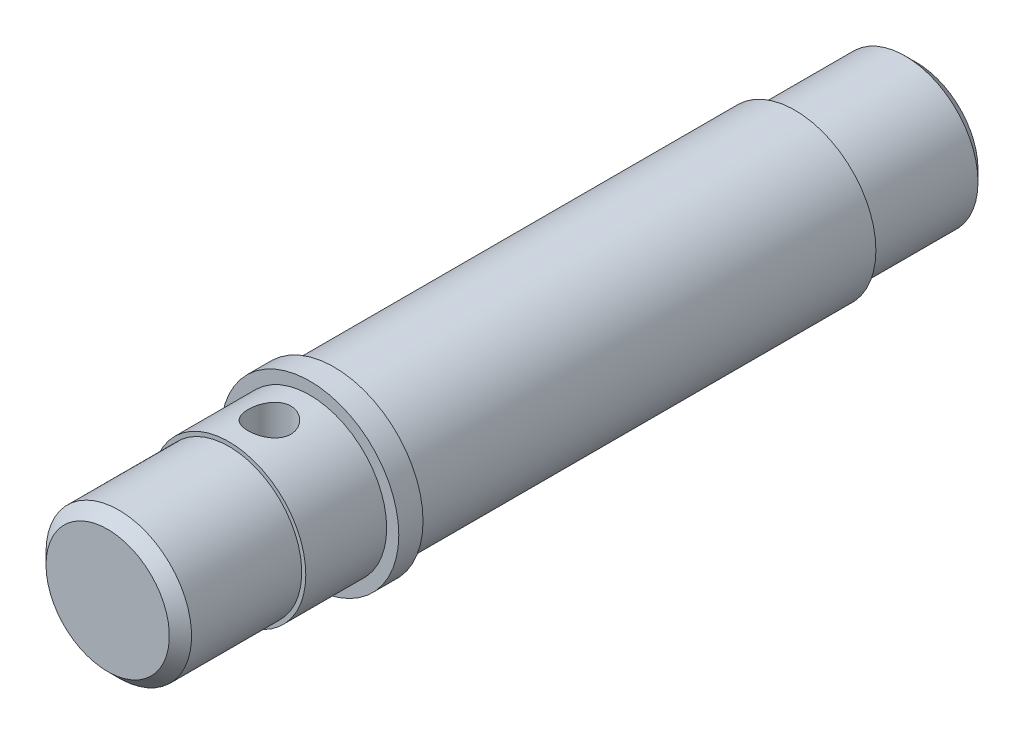
ISO-10303-21;
HEADER;
FILE_DESCRIPTION(('STEP AP214'),'2;1');
FILE_NAME('part.step','',(''),(''),'','','');
FILE_SCHEMA(('AUTOMOTIVE_DESIGN { 1 0 10303 214 1 1 1 1 }'));
ENDSEC;
DATA;
#1=APPLICATION_CONTEXT('core data for automotive mechanical design processes');
#2=APPLICATION_PROTOCOL_DEFINITION('international standard','automotive_design',2000,#1);
#3=PRODUCT_CONTEXT('',#1,'mechanical');
#4=PRODUCT('Part','Part','',(#3));
#5=PRODUCT_RELATED_PRODUCT_CATEGORY('part','',(#4));
#6=PRODUCT_DEFINITION_FORMATION('','',#4);
#7=PRODUCT_DEFINITION_CONTEXT('part definition',#1,'design');
#8=PRODUCT_DEFINITION('design','',#6,#7);
#9=PRODUCT_DEFINITION_SHAPE('','',#8);
#10=(LENGTH_UNIT() NAMED_UNIT(*) SI_UNIT(.MILLI.,.METRE.));
#11=(NAMED_UNIT(*) PLANE_ANGLE_UNIT() SI_UNIT($,.RADIAN.));
#12=(NAMED_UNIT(*) SI_UNIT($,.STERADIAN.) SOLID_ANGLE_UNIT());
#13=UNCERTAINTY_MEASURE_WITH_UNIT(LENGTH_MEASURE(1.E-05),#10,'distance_accuracy_value','');
#14=(GEOMETRIC_REPRESENTATION_CONTEXT(3) GLOBAL_UNCERTAINTY_ASSIGNED_CONTEXT((#13)) GLOBAL_UNIT_ASSIGNED_CONTEXT((#10,
#11,#12)) REPRESENTATION_CONTEXT('',''));
#15=CARTESIAN_POINT('',(0.,0.,0.));
#16=DIRECTION('',(0.,0.,1.));
#17=DIRECTION('',(1.,0.,0.));
#18=AXIS2_PLACEMENT_3D('',#15,#16,#17);
#19=CARTESIAN_POINT('',(0.,0.,25.));
#20=DIRECTION('',(0.,0.,1.));
#21=DIRECTION('',(1.,0.,0.));
#22=AXIS2_PLACEMENT_3D('',#19,#20,#21);
#23=PLANE('',#22);
#24=CARTESIAN_POINT('',(0.,0.,25.));
#25=DIRECTION('',(0.,0.,1.));
#26=DIRECTION('',(1.,0.,0.));
#27=AXIS2_PLACEMENT_3D('',#24,#25,#26);
#28=CIRCLE('',#27,9.5);
#29=CARTESIAN_POINT('',(9.5,0.,25.));
#30=VERTEX_POINT('',#29);
#31=EDGE_CURVE('E88',#30,#30,#28,.T.);
#32=ORIENTED_EDGE('',*,*,#31,.F.);
#33=EDGE_LOOP('',(#32));
#34=FACE_BOUND('',#33,.T.);
#35=CARTESIAN_POINT('',(0.,0.,25.));
#36=DIRECTION('',(0.,0.,1.));
#37=DIRECTION('',(1.,0.,0.));
#38=AXIS2_PLACEMENT_3D('',#35,#36,#37);
#39=CIRCLE('',#38,11.);
#40=CARTESIAN_POINT('',(11.,0.,25.));
#41=VERTEX_POINT('',#40);
#42=EDGE_CURVE('E86',#41,#41,#39,.T.);
#43=ORIENTED_EDGE('',*,*,#42,.T.);
#44=EDGE_LOOP('',(#43));
#45=FACE_BOUND('',#44,.T.);
#46=ADVANCED_FACE('F37',(#34,#45),#23,.T.);
#47=CARTESIAN_POINT('',(0.,0.,25.));
#48=DIRECTION('',(0.,0.,1.));
#49=DIRECTION('',(1.,0.,0.));
#50=AXIS2_PLACEMENT_3D('',#47,#48,#49);
#51=CYLINDRICAL_SURFACE('',#50,9.5);
#52=CARTESIAN_POINT('',(0.,-9.5,32.65));
#53=CARTESIAN_POINT('',(-0.145834099659647,-9.49999808003396,32.6499970892488));
#54=CARTESIAN_POINT('',(-0.29169853280151,-9.49660924277311,32.6379215236776));
#55=CARTESIAN_POINT('',(-0.579209025378518,-9.48342026335043,32.590034103422));
#56=CARTESIAN_POINT('',(-0.720853306420267,-9.47361745717199,32.554212385786));
#57=CARTESIAN_POINT('',(-0.995733085594923,-9.44867973836868,32.4601002482184));
#58=CARTESIAN_POINT('',(-1.12897970626465,-9.43355206119978,32.4018403073694));
#59=CARTESIAN_POINT('',(-1.38381191790007,-9.3995538499071,32.2646228345878));
#60=CARTESIAN_POINT('',(-1.50539644494426,-9.3806829747759,32.1856634167103));
#61=CARTESIAN_POINT('',(-1.73651346473491,-9.34069592065438,32.0071913133959));
#62=CARTESIAN_POINT('',(-1.84571067986586,-9.319538572778,31.907253678426));
#63=CARTESIAN_POINT('',(-2.04603303477211,-9.27762064224113,31.6905693940427));
#64=CARTESIAN_POINT('',(-2.13715560823632,-9.25686011630064,31.5738203617344));
#65=CARTESIAN_POINT('',(-2.30042238948461,-9.21766030723124,31.324094257744));
#66=CARTESIAN_POINT('',(-2.37217256452617,-9.19927269829441,31.1908507115809));
#67=CARTESIAN_POINT('',(-2.49211664237425,-9.16750956038129,30.9135947062189));
#68=CARTESIAN_POINT('',(-2.54031534757675,-9.15413300972667,30.7695844493785));
#69=CARTESIAN_POINT('',(-2.61060797764441,-9.13433300205164,30.4786153692976));
#70=CARTESIAN_POINT('',(-2.63331353099395,-9.12774696022364,30.3318156466656));
#71=CARTESIAN_POINT('',(-2.65388335464118,-9.12178862533113,30.0363542820331));
#72=CARTESIAN_POINT('',(-2.65175274497967,-9.12241484543938,29.8876930301041));
#73=CARTESIAN_POINT('',(-2.62319444098087,-9.13066526365298,29.5975717854547));
#74=CARTESIAN_POINT('',(-2.59751590079997,-9.13807368060119,29.4560309228507));
#75=CARTESIAN_POINT('',(-2.52379425702127,-9.15870697367352,29.179351083596));
#76=CARTESIAN_POINT('',(-2.47574921646429,-9.17193235354642,29.0442126625195));
#77=CARTESIAN_POINT('',(-2.35806914290097,-9.20289281896455,28.7822641177744));
#78=CARTESIAN_POINT('',(-2.28817854584758,-9.22068081442196,28.6555753247165));
#79=CARTESIAN_POINT('',(-2.1289693064579,-9.25873489194035,28.4154649871327));
#80=CARTESIAN_POINT('',(-2.0396465184901,-9.27900150238039,28.3020462815776));
#81=CARTESIAN_POINT('',(-1.84031693964528,-9.32061932177232,28.0874260822207));
#82=CARTESIAN_POINT('',(-1.72968358651565,-9.34198337059302,27.9868081163292));
#83=CARTESIAN_POINT('',(-1.49285002816034,-9.38274031502671,27.8054279760459));
#84=CARTESIAN_POINT('',(-1.36664908993165,-9.40213311774469,27.7246667371484));
#85=CARTESIAN_POINT('',(-1.10130357447118,-9.43690108966364,27.5850017011411));
#86=CARTESIAN_POINT('',(-0.962096026667359,-9.45225517752446,27.5262119456913));
#87=CARTESIAN_POINT('',(-0.675245266974981,-9.47706370900547,27.4330427230765));
#88=CARTESIAN_POINT('',(-0.527604087500578,-9.48651956754251,27.3986574012976));
#89=CARTESIAN_POINT('',(-0.233050069384359,-9.49824872488775,27.3562088956372));
#90=CARTESIAN_POINT('',(-0.0862598608986284,-9.50073818033956,27.3473532921997));
#91=CARTESIAN_POINT('',(0.206711327506864,-9.49888001176469,27.3540156161572));
#92=CARTESIAN_POINT('',(0.352892374920167,-9.49453316652918,27.3695307672364));
#93=CARTESIAN_POINT('',(0.637609596926216,-9.47963117752455,27.4238471697617));
#94=CARTESIAN_POINT('',(0.77623837832273,-9.46919594523129,27.4621989436126));
#95=CARTESIAN_POINT('',(1.04507541794759,-9.44330827981004,27.5605712990768));
#96=CARTESIAN_POINT('',(1.17528272091442,-9.42785527870138,27.6205943338301));
#97=CARTESIAN_POINT('',(1.42660198118864,-9.3931490393351,27.7620249160585));
#98=CARTESIAN_POINT('',(1.54746661217034,-9.37382304855229,27.8438536455361));
#99=CARTESIAN_POINT('',(1.77402443244138,-9.33360053816328,28.0260498369027));
#100=CARTESIAN_POINT('',(1.87971432541363,-9.3127036788242,28.1264213159265));
#101=CARTESIAN_POINT('',(2.07631661424361,-9.27088665698881,28.3465630552236));
#102=CARTESIAN_POINT('',(2.16666790597566,-9.24998593956095,28.466839105593));
#103=CARTESIAN_POINT('',(2.32592650639015,-9.21123274860881,28.721293997429));
#104=CARTESIAN_POINT('',(2.39483462545746,-9.19338015990053,28.8554723132429));
#105=CARTESIAN_POINT('',(2.50873963667734,-9.16295278837751,29.1333190354824));
#106=CARTESIAN_POINT('',(2.55386845627225,-9.15034896899329,29.2769300014178));
#107=CARTESIAN_POINT('',(2.61920650466114,-9.13186357313916,29.5701192379367));
#108=CARTESIAN_POINT('',(2.63942284707313,-9.12598007775354,29.7196957924799));
#109=CARTESIAN_POINT('',(2.65392530069779,-9.12177227455126,30.0147968405735));
#110=CARTESIAN_POINT('',(2.64911755509749,-9.12318379474538,30.160273670962));
#111=CARTESIAN_POINT('',(2.61583198459762,-9.13278252711367,30.4482543436127));
#112=CARTESIAN_POINT('',(2.5873548816262,-9.14096953263185,30.590758276414));
#113=CARTESIAN_POINT('',(2.50808651198729,-9.16303214838051,30.8674867810268));
#114=CARTESIAN_POINT('',(2.45750430350275,-9.17685438339215,31.0017757971862));
#115=CARTESIAN_POINT('',(2.33562324145772,-9.20862707206947,31.2600660055611));
#116=CARTESIAN_POINT('',(2.2643208674348,-9.2265782271517,31.3840654449184));
#117=CARTESIAN_POINT('',(2.10034943767856,-9.26530266394752,31.6225395865211));
#118=CARTESIAN_POINT('',(2.00707026212505,-9.28614781193328,31.7365831453507));
#119=CARTESIAN_POINT('',(1.80293119622318,-9.32792989495429,31.9476927522994));
#120=CARTESIAN_POINT('',(1.6920669436954,-9.34886685150737,32.0447545753078));
#121=CARTESIAN_POINT('',(1.45268575453286,-9.38907694788089,32.2214548451116));
#122=CARTESIAN_POINT('',(1.32380808582086,-9.40829789586412,32.3006175642999));
#123=CARTESIAN_POINT('',(1.05403847382745,-9.44232134633193,32.436031648748));
#124=CARTESIAN_POINT('',(0.91315357448907,-9.45712641672552,32.4922963365735));
#125=CARTESIAN_POINT('',(0.644188994233579,-9.47895312134662,32.5737819027664));
#126=CARTESIAN_POINT('',(0.517162867654344,-9.48678552103202,32.6022935240701));
#127=CARTESIAN_POINT('',(0.260098960384674,-9.49730950750576,32.6404027337491));
#128=CARTESIAN_POINT('',(0.130061543653,-9.50000171231384,32.6500025959415));
#129=CARTESIAN_POINT('',(0.,-9.5,32.65));
#130=B_SPLINE_CURVE_WITH_KNOTS('',3,(#52,#53,#54,#55,#56,#57,#58,#59,#60,#61,#62,#63,#64,#65,
#66,#67,#68,#69,#70,#71,#72,#73,#74,#75,#76,#77,#78,#79,#80,#81,#82,#83,#84,#85,#86,#87,#88,#89,
#90,#91,#92,#93,#94,#95,#96,#97,#98,#99,#100,#101,#102,#103,#104,#105,#106,#107,#108,#109,#110,
#111,#112,#113,#114,#115,#116,#117,#118,#119,#120,#121,#122,#123,#124,#125,#126,#127,#128,#129),
.UNSPECIFIED.,.T.,.F.,(4,2,2,2,2,2,2,2,2,2,2,2,2,2,2,2,2,2,2,2,2,2,2,2,2,2,2,2,2,2,2,2,2,2,2,2,
2,2,4),(0.,0.437025057290833,0.874231746534771,1.31084663642181,1.74750132045254,
2.19404432923995,2.64065069470653,3.09575349682394,3.5507634598577,3.99460665432257,
4.43835835095524,4.86846460702024,5.29860811760715,5.7339849946957,6.16945484561194,
6.62053142401494,7.07162924956577,7.52503698334629,7.97833590799369,8.41740486750905,
8.85642381192403,9.28707490591835,9.71777476397868,10.1574868453409,10.5972942986719,
11.0507653351607,11.5042192318955,11.955130150966,12.4059122850976,12.8404873460808,
13.2750491527768,13.7055871609701,14.1361983625923,14.5805737397579,15.025059522207,
15.4802463450493,15.9351679505046,16.3249738258041,16.714732830721),.UNSPECIFIED.);
#131=CARTESIAN_POINT('',(0.,-9.5,32.65));
#132=VERTEX_POINT('',#131);
#133=EDGE_CURVE('E64',#132,#132,#130,.T.);
#134=ORIENTED_EDGE('',*,*,#133,.F.);
#135=EDGE_LOOP('',(#134));
#136=FACE_BOUND('',#135,.T.);
#137=CARTESIAN_POINT('',(0.,9.5,27.35));
#138=CARTESIAN_POINT('',(-0.145834099659647,9.49999808003396,27.3500029107512));
#139=CARTESIAN_POINT('',(-0.291698532801511,9.49660924277311,27.3620784763224));
#140=CARTESIAN_POINT('',(-0.579209025378518,9.48342026335043,27.409965896578));
#141=CARTESIAN_POINT('',(-0.720853306420266,9.47361745717199,27.445787614214));
#142=CARTESIAN_POINT('',(-0.995733085594921,9.44867973836868,27.5398997517816));
#143=CARTESIAN_POINT('',(-1.12897970626465,9.43355206119978,27.5981596926306));
#144=CARTESIAN_POINT('',(-1.38381191790007,9.3995538499071,27.7353771654122));
#145=CARTESIAN_POINT('',(-1.50539644494426,9.3806829747759,27.8143365832897));
#146=CARTESIAN_POINT('',(-1.73651346473491,9.34069592065438,27.9928086866042));
#147=CARTESIAN_POINT('',(-1.84571067986586,9.319538572778,28.092746321574));
#148=CARTESIAN_POINT('',(-2.04603303477211,9.27762064224113,28.3094306059573));
#149=CARTESIAN_POINT('',(-2.13715560823632,9.25686011630064,28.4261796382656));
#150=CARTESIAN_POINT('',(-2.30042238948461,9.21766030723124,28.675905742256));
#151=CARTESIAN_POINT('',(-2.37217256452617,9.19927269829441,28.8091492884191));
#152=CARTESIAN_POINT('',(-2.49211664237425,9.16750956038129,29.0864052937811));
#153=CARTESIAN_POINT('',(-2.54031534757675,9.15413300972666,29.2304155506215));
#154=CARTESIAN_POINT('',(-2.61060797764441,9.13433300205164,29.5213846307024));
#155=CARTESIAN_POINT('',(-2.63331353099395,9.12774696022364,29.6681843533344));
#156=CARTESIAN_POINT('',(-2.65388335464118,9.12178862533113,29.9636457179669));
#157=CARTESIAN_POINT('',(-2.65175274497967,9.12241484543938,30.1123069698959));
#158=CARTESIAN_POINT('',(-2.62319444098087,9.13066526365298,30.4024282145453));
#159=CARTESIAN_POINT('',(-2.59751590079998,9.13807368060119,30.5439690771493));
#160=CARTESIAN_POINT('',(-2.52379425702127,9.15870697367352,30.820648916404));
#161=CARTESIAN_POINT('',(-2.47574921646429,9.17193235354642,30.9557873374805));
#162=CARTESIAN_POINT('',(-2.35806914290097,9.20289281896455,31.2177358822256));
#163=CARTESIAN_POINT('',(-2.28817854584758,9.22068081442196,31.3444246752835));
#164=CARTESIAN_POINT('',(-2.1289693064579,9.25873489194035,31.5845350128673));
#165=CARTESIAN_POINT('',(-2.03964651849011,9.27900150238039,31.6979537184224));
#166=CARTESIAN_POINT('',(-1.84031693964528,9.32061932177232,31.9125739177793));
#167=CARTESIAN_POINT('',(-1.72968358651565,9.34198337059303,32.0131918836708));
#168=CARTESIAN_POINT('',(-1.49285002816033,9.38274031502671,32.1945720239541));
#169=CARTESIAN_POINT('',(-1.36664908993165,9.40213311774469,32.2753332628516));
#170=CARTESIAN_POINT('',(-1.10130357447117,9.43690108966364,32.4149982988589));
#171=CARTESIAN_POINT('',(-0.962096026667357,9.45225517752446,32.4737880543087));
#172=CARTESIAN_POINT('',(-0.675245266974981,9.47706370900547,32.5669572769235));
#173=CARTESIAN_POINT('',(-0.527604087500579,9.48651956754251,32.6013425987024));
#174=CARTESIAN_POINT('',(-0.233050069384361,9.49824872488775,32.6437911043628));
#175=CARTESIAN_POINT('',(-0.0862598608986302,9.50073818033956,32.6526467078003));
#176=CARTESIAN_POINT('',(0.206711327506863,9.49888001176469,32.6459843838428));
#177=CARTESIAN_POINT('',(0.352892374920166,9.49453316652918,32.6304692327636));
#178=CARTESIAN_POINT('',(0.637609596926215,9.47963117752455,32.5761528302383));
#179=CARTESIAN_POINT('',(0.776238378322729,9.46919594523129,32.5378010563874));
#180=CARTESIAN_POINT('',(1.04507541794759,9.44330827981004,32.4394287009232));
#181=CARTESIAN_POINT('',(1.17528272091442,9.42785527870138,32.37940566617));
#182=CARTESIAN_POINT('',(1.42660198118864,9.3931490393351,32.2379750839415));
#183=CARTESIAN_POINT('',(1.54746661217034,9.3738230485523,32.1561463544639));
#184=CARTESIAN_POINT('',(1.77402443244138,9.33360053816329,31.9739501630973));
#185=CARTESIAN_POINT('',(1.87971432541363,9.3127036788242,31.8735786840735));
#186=CARTESIAN_POINT('',(2.07631661424361,9.27088665698881,31.6534369447764));
#187=CARTESIAN_POINT('',(2.16666790597566,9.24998593956095,31.533160894407));
#188=CARTESIAN_POINT('',(2.32592650639015,9.21123274860882,31.278706002571));
#189=CARTESIAN_POINT('',(2.39483462545746,9.19338015990053,31.1445276867571));
#190=CARTESIAN_POINT('',(2.50873963667734,9.16295278837751,30.8666809645176));
#191=CARTESIAN_POINT('',(2.55386845627225,9.15034896899329,30.7230699985822));
#192=CARTESIAN_POINT('',(2.61920650466114,9.13186357313916,30.4298807620633));
#193=CARTESIAN_POINT('',(2.63942284707313,9.12598007775354,30.2803042075201));
#194=CARTESIAN_POINT('',(2.65392530069779,9.12177227455126,29.9852031594265));
#195=CARTESIAN_POINT('',(2.64911755509749,9.12318379474538,29.839726329038));
#196=CARTESIAN_POINT('',(2.61583198459762,9.13278252711367,29.5517456563873));
#197=CARTESIAN_POINT('',(2.5873548816262,9.14096953263185,29.409241723586));
#198=CARTESIAN_POINT('',(2.50808651198729,9.16303214838051,29.1325132189732));
#199=CARTESIAN_POINT('',(2.45750430350275,9.17685438339215,28.9982242028139));
#200=CARTESIAN_POINT('',(2.33562324145772,9.20862707206947,28.7399339944389));
#201=CARTESIAN_POINT('',(2.2643208674348,9.2265782271517,28.6159345550816));
#202=CARTESIAN_POINT('',(2.10034943767856,9.26530266394752,28.3774604134789));
#203=CARTESIAN_POINT('',(2.00707026212505,9.28614781193328,28.2634168546493));
#204=CARTESIAN_POINT('',(1.80293119622318,9.32792989495429,28.0523072477006));
#205=CARTESIAN_POINT('',(1.6920669436954,9.34886685150737,27.9552454246922));
#206=CARTESIAN_POINT('',(1.45268575453286,9.3890769478809,27.7785451548884));
#207=CARTESIAN_POINT('',(1.32380808582085,9.40829789586412,27.6993824357001));
#208=CARTESIAN_POINT('',(1.05403847382745,9.44232134633192,27.563968351252));
#209=CARTESIAN_POINT('',(0.91315357448907,9.45712641672552,27.5077036634265));
#210=CARTESIAN_POINT('',(0.64418899423358,9.47895312134662,27.4262180972336));
#211=CARTESIAN_POINT('',(0.517162867654344,9.48678552103202,27.3977064759299));
#212=CARTESIAN_POINT('',(0.260098960384673,9.49730950750576,27.3595972662509));
#213=CARTESIAN_POINT('',(0.130061543653,9.50000171231384,27.3499974040585));
#214=CARTESIAN_POINT('',(0.,9.5,27.35));
#215=B_SPLINE_CURVE_WITH_KNOTS('',3,(#137,#138,#139,#140,#141,#142,#143,#144,#145,#146,#147,
#148,#149,#150,#151,#152,#153,#154,#155,#156,#157,#158,#159,#160,#161,#162,#163,#164,#165,#166,
#167,#168,#169,#170,#171,#172,#173,#174,#175,#176,#177,#178,#179,#180,#181,#182,#183,#184,#185,
#186,#187,#188,#189,#190,#191,#192,#193,#194,#195,#196,#197,#198,#199,#200,#201,#202,#203,#204,
#205,#206,#207,#208,#209,#210,#211,#212,#213,#214),.UNSPECIFIED.,.T.,.F.,(4,2,2,2,2,2,2,2,2,2,2,
2,2,2,2,2,2,2,2,2,2,2,2,2,2,2,2,2,2,2,2,2,2,2,2,2,2,2,4),(0.,0.437025057290833,
0.874231746534771,1.31084663642181,1.74750132045254,2.19404432923995,2.64065069470652,
3.09575349682394,3.5507634598577,3.99460665432256,4.43835835095524,4.86846460702024,
5.29860811760714,5.7339849946957,6.16945484561194,6.62053142401494,7.07162924956577,
7.52503698334629,7.97833590799369,8.41740486750904,8.85642381192403,9.28707490591834,
9.71777476397867,10.1574868453409,10.5972942986718,11.0507653351607,11.5042192318954,
11.955130150966,12.4059122850976,12.8404873460808,13.2750491527768,13.7055871609701,
14.1361983625923,14.5805737397579,15.025059522207,15.4802463450493,15.9351679505046,
16.3249738258041,16.714732830721),.UNSPECIFIED.);
#216=CARTESIAN_POINT('',(0.,9.5,27.35));
#217=VERTEX_POINT('',#216);
#218=EDGE_CURVE('E56',#217,#217,#215,.T.);
#219=ORIENTED_EDGE('',*,*,#218,.F.);
#220=EDGE_LOOP('',(#219));
#221=FACE_BOUND('',#220,.T.);
#222=ORIENTED_EDGE('',*,*,#31,.T.);
#223=EDGE_LOOP('',(#222));
#224=FACE_BOUND('',#223,.T.);
#225=CARTESIAN_POINT('',(0.,0.,35.));
#226=DIRECTION('',(0.,0.,1.));
#227=DIRECTION('',(1.,0.,0.));
#228=AXIS2_PLACEMENT_3D('',#225,#226,#227);
#229=CIRCLE('',#228,9.5);
#230=CARTESIAN_POINT('',(9.5,0.,35.));
#231=VERTEX_POINT('',#230);
#232=EDGE_CURVE('E63',#231,#231,#229,.T.);
#233=ORIENTED_EDGE('',*,*,#232,.F.);
#234=EDGE_LOOP('',(#233));
#235=FACE_BOUND('',#234,.T.);
#236=ADVANCED_FACE('F65',(#136,#221,#224,#235),#51,.T.);
#237=CARTESIAN_POINT('',(0.,0.,50.));
#238=DIRECTION('',(0.,0.,1.));
#239=DIRECTION('',(1.,0.,0.));
#240=AXIS2_PLACEMENT_3D('',#237,#238,#239);
#241=PLANE('',#240);
#242=CARTESIAN_POINT('',(0.,0.,50.));
#243=DIRECTION('',(0.,0.,-1.));
#244=DIRECTION('',(-1.,0.,0.));
#245=AXIS2_PLACEMENT_3D('',#242,#243,#244);
#246=CIRCLE('',#245,7.626);
#247=CARTESIAN_POINT('',(-7.626,0.,50.));
#248=VERTEX_POINT('',#247);
#249=EDGE_CURVE('E96',#248,#248,#246,.T.);
#250=ORIENTED_EDGE('',*,*,#249,.F.);
#251=EDGE_LOOP('',(#250));
#252=FACE_BOUND('',#251,.T.);
#253=ADVANCED_FACE('F125',(#252),#241,.T.);
#254=CARTESIAN_POINT('',(0.,0.,50.));
#255=DIRECTION('',(0.,0.,-1.));
#256=DIRECTION('',(-1.,0.,0.));
#257=AXIS2_PLACEMENT_3D('',#254,#255,#256);
#258=CONICAL_SURFACE('',#257,7.626,0.78539816339745);
#259=CARTESIAN_POINT('',(0.,0.,48.626));
#260=DIRECTION('',(0.,0.,-1.));
#261=DIRECTION('',(-1.,0.,0.));
#262=AXIS2_PLACEMENT_3D('',#259,#260,#261);
#263=CIRCLE('',#262,9.);
#264=CARTESIAN_POINT('',(-9.,0.,48.626));
#265=VERTEX_POINT('',#264);
#266=EDGE_CURVE('E91',#265,#265,#263,.T.);
#267=ORIENTED_EDGE('',*,*,#266,.F.);
#268=EDGE_LOOP('',(#267));
#269=FACE_BOUND('',#268,.T.);
#270=ORIENTED_EDGE('',*,*,#249,.T.);
#271=EDGE_LOOP('',(#270));
#272=FACE_BOUND('',#271,.T.);
#273=ADVANCED_FACE('F130',(#269,#272),#258,.T.);
#274=CARTESIAN_POINT('',(0.,0.,50.));
#275=DIRECTION('',(0.,0.,-1.));
#276=DIRECTION('',(-1.,0.,0.));
#277=AXIS2_PLACEMENT_3D('',#274,#275,#276);
#278=CYLINDRICAL_SURFACE('',#277,9.);
#279=CARTESIAN_POINT('',(0.,0.,35.));
#280=DIRECTION('',(0.,0.,-1.));
#281=DIRECTION('',(-1.,0.,0.));
#282=AXIS2_PLACEMENT_3D('',#279,#280,#281);
#283=CIRCLE('',#282,9.);
#284=CARTESIAN_POINT('',(-9.,0.,35.));
#285=VERTEX_POINT('',#284);
#286=EDGE_CURVE('E99',#285,#285,#283,.T.);
#287=ORIENTED_EDGE('',*,*,#286,.F.);
#288=EDGE_LOOP('',(#287));
#289=FACE_BOUND('',#288,.T.);
#290=ORIENTED_EDGE('',*,*,#266,.T.);
#291=EDGE_LOOP('',(#290));
#292=FACE_BOUND('',#291,.T.);
#293=ADVANCED_FACE('F133',(#289,#292),#278,.T.);
#294=CARTESIAN_POINT('',(9.,0.,35.));
#295=DIRECTION('',(0.,0.,-1.));
#296=DIRECTION('',(-1.,0.,0.));
#297=AXIS2_PLACEMENT_3D('',#294,#295,#296);
#298=PLANE('',#297);
#299=ORIENTED_EDGE('',*,*,#286,.T.);
#300=EDGE_LOOP('',(#299));
#301=FACE_BOUND('',#300,.T.);
#302=ORIENTED_EDGE('',*,*,#232,.T.);
#303=EDGE_LOOP('',(#302));
#304=FACE_BOUND('',#303,.T.);
#305=ADVANCED_FACE('F73',(#301,#304),#298,.F.);
#306=CARTESIAN_POINT('',(0.,0.,30.));
#307=DIRECTION('',(0.,-1.,0.));
#308=DIRECTION('',(0.,0.,-1.));
#309=AXIS2_PLACEMENT_3D('',#306,#307,#308);
#310=CYLINDRICAL_SURFACE('',#309,2.65);
#311=ORIENTED_EDGE('',*,*,#218,.T.);
#312=EDGE_LOOP('',(#311));
#313=FACE_BOUND('',#312,.T.);
#314=ORIENTED_EDGE('',*,*,#133,.T.);
#315=EDGE_LOOP('',(#314));
#316=FACE_BOUND('',#315,.T.);
#317=ADVANCED_FACE('F68',(#313,#316),#310,.F.);
#318=CARTESIAN_POINT('',(0.,0.,22.));
#319=DIRECTION('',(0.,0.,1.));
#320=DIRECTION('',(1.,0.,0.));
#321=AXIS2_PLACEMENT_3D('',#318,#319,#320);
#322=CYLINDRICAL_SURFACE('',#321,11.);
#323=CARTESIAN_POINT('',(0.,0.,22.));
#324=DIRECTION('',(0.,0.,1.));
#325=DIRECTION('',(1.,0.,0.));
#326=AXIS2_PLACEMENT_3D('',#323,#324,#325);
#327=CIRCLE('',#326,11.);
#328=CARTESIAN_POINT('',(11.,0.,22.));
#329=VERTEX_POINT('',#328);
#330=EDGE_CURVE('E85',#329,#329,#327,.T.);
#331=ORIENTED_EDGE('',*,*,#330,.T.);
#332=EDGE_LOOP('',(#331));
#333=FACE_BOUND('',#332,.T.);
#334=ORIENTED_EDGE('',*,*,#42,.F.);
#335=EDGE_LOOP('',(#334));
#336=FACE_BOUND('',#335,.T.);
#337=ADVANCED_FACE('F72',(#333,#336),#322,.T.);
#338=CARTESIAN_POINT('',(0.,0.,22.));
#339=DIRECTION('',(0.,0.,1.));
#340=DIRECTION('',(1.,0.,0.));
#341=AXIS2_PLACEMENT_3D('',#338,#339,#340);
#342=PLANE('',#341);
#343=CARTESIAN_POINT('',(0.,0.,22.));
#344=DIRECTION('',(0.,0.,1.));
#345=DIRECTION('',(1.,0.,0.));
#346=AXIS2_PLACEMENT_3D('',#343,#344,#345);
#347=CIRCLE('',#346,10.);
#348=CARTESIAN_POINT('',(10.,0.,22.));
#349=VERTEX_POINT('',#348);
#350=EDGE_CURVE('E10',#349,#349,#347,.T.);
#351=ORIENTED_EDGE('',*,*,#350,.T.);
#352=EDGE_LOOP('',(#351));
#353=FACE_BOUND('',#352,.T.);
#354=ORIENTED_EDGE('',*,*,#330,.F.);
#355=EDGE_LOOP('',(#354));
#356=FACE_BOUND('',#355,.T.);
#357=ADVANCED_FACE('F111',(#353,#356),#342,.F.);
#358=CARTESIAN_POINT('',(0.,0.,-50.));
#359=DIRECTION('',(0.,0.,1.));
#360=DIRECTION('',(1.,0.,0.));
#361=AXIS2_PLACEMENT_3D('',#358,#359,#360);
#362=PLANE('',#361);
#363=CARTESIAN_POINT('',(0.,0.,-50.));
#364=DIRECTION('',(0.,0.,1.));
#365=DIRECTION('',(1.,0.,0.));
#366=AXIS2_PLACEMENT_3D('',#363,#364,#365);
#367=CIRCLE('',#366,7.626);
#368=CARTESIAN_POINT('',(7.626,0.,-50.));
#369=VERTEX_POINT('',#368);
#370=EDGE_CURVE('E53',#369,#369,#367,.T.);
#371=ORIENTED_EDGE('',*,*,#370,.F.);
#372=EDGE_LOOP('',(#371));
#373=FACE_BOUND('',#372,.T.);
#374=ADVANCED_FACE('F109',(#373),#362,.F.);
#375=CARTESIAN_POINT('',(0.,0.,-50.));
#376=DIRECTION('',(0.,0.,1.));
#377=DIRECTION('',(1.,0.,0.));
#378=AXIS2_PLACEMENT_3D('',#375,#376,#377);
#379=CONICAL_SURFACE('',#378,7.626,0.785398163397455);
#380=CARTESIAN_POINT('',(0.,0.,-48.626));
#381=DIRECTION('',(0.,0.,1.));
#382=DIRECTION('',(1.,0.,0.));
#383=AXIS2_PLACEMENT_3D('',#380,#381,#382);
#384=CIRCLE('',#383,9.);
#385=CARTESIAN_POINT('',(9.,0.,-48.626));
#386=VERTEX_POINT('',#385);
#387=EDGE_CURVE('E102',#386,#386,#384,.T.);
#388=ORIENTED_EDGE('',*,*,#387,.F.);
#389=EDGE_LOOP('',(#388));
#390=FACE_BOUND('',#389,.T.);
#391=ORIENTED_EDGE('',*,*,#370,.T.);
#392=EDGE_LOOP('',(#391));
#393=FACE_BOUND('',#392,.T.);
#394=ADVANCED_FACE('F107',(#390,#393),#379,.T.);
#395=CARTESIAN_POINT('',(0.,0.,-50.));
#396=DIRECTION('',(0.,0.,1.));
#397=DIRECTION('',(1.,0.,0.));
#398=AXIS2_PLACEMENT_3D('',#395,#396,#397);
#399=CYLINDRICAL_SURFACE('',#398,9.);
#400=CARTESIAN_POINT('',(0.,0.,-35.));
#401=DIRECTION('',(0.,0.,1.));
#402=DIRECTION('',(1.,0.,0.));
#403=AXIS2_PLACEMENT_3D('',#400,#401,#402);
#404=CIRCLE('',#403,9.);
#405=CARTESIAN_POINT('',(9.,0.,-35.));
#406=VERTEX_POINT('',#405);
#407=EDGE_CURVE('E44',#406,#406,#404,.T.);
#408=ORIENTED_EDGE('',*,*,#407,.F.);
#409=EDGE_LOOP('',(#408));
#410=FACE_BOUND('',#409,.T.);
#411=ORIENTED_EDGE('',*,*,#387,.T.);
#412=EDGE_LOOP('',(#411));
#413=FACE_BOUND('',#412,.T.);
#414=ADVANCED_FACE('F116',(#410,#413),#399,.T.);
#415=CARTESIAN_POINT('',(9.,0.,-35.));
#416=DIRECTION('',(0.,0.,1.));
#417=DIRECTION('',(1.,0.,0.));
#418=AXIS2_PLACEMENT_3D('',#415,#416,#417);
#419=PLANE('',#418);
#420=CARTESIAN_POINT('',(0.,0.,-35.));
#421=DIRECTION('',(0.,0.,1.));
#422=DIRECTION('',(1.,0.,0.));
#423=AXIS2_PLACEMENT_3D('',#420,#421,#422);
#424=CIRCLE('',#423,9.99999999999999);
#425=CARTESIAN_POINT('',(9.99999999999999,0.,-35.));
#426=VERTEX_POINT('',#425);
#427=EDGE_CURVE('E48',#426,#426,#424,.T.);
#428=ORIENTED_EDGE('',*,*,#427,.F.);
#429=EDGE_LOOP('',(#428));
#430=FACE_BOUND('',#429,.T.);
#431=ORIENTED_EDGE('',*,*,#407,.T.);
#432=EDGE_LOOP('',(#431));
#433=FACE_BOUND('',#432,.T.);
#434=ADVANCED_FACE('F141',(#430,#433),#419,.F.);
#435=CARTESIAN_POINT('',(0.,0.,50.));
#436=DIRECTION('',(0.,0.,-1.));
#437=DIRECTION('',(-1.,0.,0.));
#438=AXIS2_PLACEMENT_3D('',#435,#436,#437);
#439=CYLINDRICAL_SURFACE('',#438,10.);
#440=ORIENTED_EDGE('',*,*,#427,.T.);
#441=EDGE_LOOP('',(#440));
#442=FACE_BOUND('',#441,.T.);
#443=ORIENTED_EDGE('',*,*,#350,.F.);
#444=EDGE_LOOP('',(#443));
#445=FACE_BOUND('',#444,.T.);
#446=ADVANCED_FACE('F39',(#442,#445),#439,.T.);
#447=CLOSED_SHELL('',(#46,#236,#253,#273,#293,#305,#317,#337,#357,#374,#394,#414,#434,#446));
#448=MANIFOLD_SOLID_BREP('B2',#447);
#449=ADVANCED_BREP_SHAPE_REPRESENTATION('',(#18,#448),#14);
#450=SHAPE_DEFINITION_REPRESENTATION(#9,#449);
ENDSEC;
END-ISO-10303-21;
